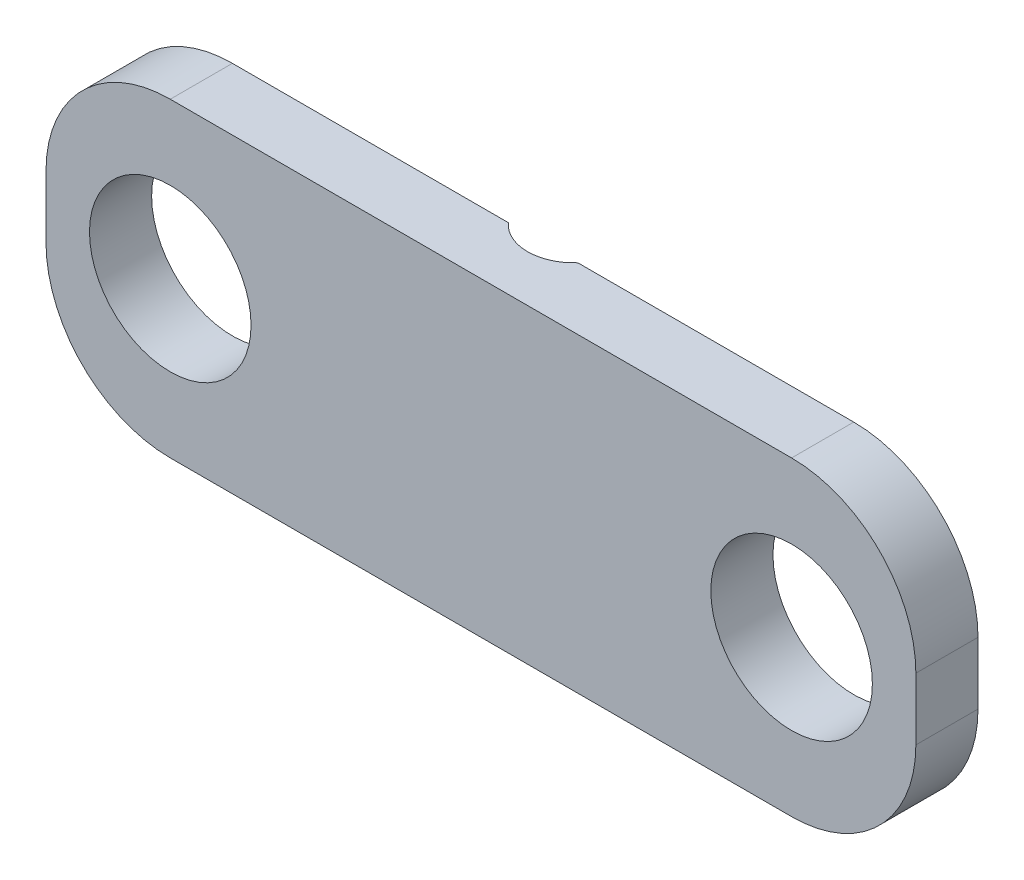
ISO-10303-21;
HEADER;
FILE_DESCRIPTION(('STEP AP214'),'2;1');
FILE_NAME('part.step','',(''),(''),'','','');
FILE_SCHEMA(('AUTOMOTIVE_DESIGN { 1 0 10303 214 1 1 1 1 }'));
ENDSEC;
DATA;
#1=APPLICATION_CONTEXT('core data for automotive mechanical design processes');
#2=APPLICATION_PROTOCOL_DEFINITION('international standard','automotive_design',2000,#1);
#3=PRODUCT_CONTEXT('',#1,'mechanical');
#4=PRODUCT('Part','Part','',(#3));
#5=PRODUCT_RELATED_PRODUCT_CATEGORY('part','',(#4));
#6=PRODUCT_DEFINITION_FORMATION('','',#4);
#7=PRODUCT_DEFINITION_CONTEXT('part definition',#1,'design');
#8=PRODUCT_DEFINITION('design','',#6,#7);
#9=PRODUCT_DEFINITION_SHAPE('','',#8);
#10=(LENGTH_UNIT() NAMED_UNIT(*) SI_UNIT(.MILLI.,.METRE.));
#11=(NAMED_UNIT(*) PLANE_ANGLE_UNIT() SI_UNIT($,.RADIAN.));
#12=(NAMED_UNIT(*) SI_UNIT($,.STERADIAN.) SOLID_ANGLE_UNIT());
#13=UNCERTAINTY_MEASURE_WITH_UNIT(LENGTH_MEASURE(1.E-05),#10,'distance_accuracy_value','');
#14=(GEOMETRIC_REPRESENTATION_CONTEXT(3) GLOBAL_UNCERTAINTY_ASSIGNED_CONTEXT((#13)) GLOBAL_UNIT_ASSIGNED_CONTEXT((#10,
#11,#12)) REPRESENTATION_CONTEXT('',''));
#15=CARTESIAN_POINT('',(0.,0.,0.));
#16=DIRECTION('',(0.,0.,1.));
#17=DIRECTION('',(1.,0.,0.));
#18=AXIS2_PLACEMENT_3D('',#15,#16,#17);
#19=CARTESIAN_POINT('',(5.,-0.5,0.));
#20=DIRECTION('',(0.,0.,1.));
#21=DIRECTION('',(1.,0.,0.));
#22=AXIS2_PLACEMENT_3D('',#19,#20,#21);
#23=PLANE('',#22);
#24=CARTESIAN_POINT('',(-5.,0.,0.));
#25=DIRECTION('',(0.,0.,-1.));
#26=DIRECTION('',(-1.,0.,0.));
#27=AXIS2_PLACEMENT_3D('',#24,#25,#26);
#28=CIRCLE('',#27,1.3);
#29=CARTESIAN_POINT('',(-6.3,0.,0.));
#30=VERTEX_POINT('',#29);
#31=EDGE_CURVE('E368',#30,#30,#28,.T.);
#32=ORIENTED_EDGE('',*,*,#31,.F.);
#33=EDGE_LOOP('',(#32));
#34=FACE_BOUND('',#33,.T.);
#35=DIRECTION('',(-1.,0.,0.));
#36=VECTOR('',#35,1.);
#37=CARTESIAN_POINT('',(-4.99999999999999,2.5,0.));
#38=LINE('',#37,#36);
#39=CARTESIAN_POINT('',(-0.559016994374948,2.5,0.));
#40=VERTEX_POINT('',#39);
#41=CARTESIAN_POINT('',(-4.99999999999999,2.5,0.));
#42=VERTEX_POINT('',#41);
#43=EDGE_CURVE('E162',#40,#42,#38,.T.);
#44=ORIENTED_EDGE('',*,*,#43,.F.);
#45=DIRECTION('',(0.,-1.,0.));
#46=VECTOR('',#45,1.);
#47=CARTESIAN_POINT('',(-0.559016994374948,2.501,0.));
#48=LINE('',#47,#46);
#49=CARTESIAN_POINT('',(-0.559016994374948,-2.5,0.));
#50=VERTEX_POINT('',#49);
#51=EDGE_CURVE('E216',#50,#40,#48,.F.);
#52=ORIENTED_EDGE('',*,*,#51,.F.);
#53=DIRECTION('',(1.,0.,0.));
#54=VECTOR('',#53,1.);
#55=CARTESIAN_POINT('',(-4.99999999999999,-2.5,0.));
#56=LINE('',#55,#54);
#57=CARTESIAN_POINT('',(-4.99999999999999,-2.5,0.));
#58=VERTEX_POINT('',#57);
#59=EDGE_CURVE('E175',#58,#50,#56,.T.);
#60=ORIENTED_EDGE('',*,*,#59,.F.);
#61=CARTESIAN_POINT('',(-5.,-0.5,0.));
#62=DIRECTION('',(0.,0.,1.));
#63=DIRECTION('',(1.,0.,0.));
#64=AXIS2_PLACEMENT_3D('',#61,#62,#63);
#65=CIRCLE('',#64,2.);
#66=CARTESIAN_POINT('',(-7.,-0.499999999999986,0.));
#67=VERTEX_POINT('',#66);
#68=EDGE_CURVE('E172',#67,#58,#65,.T.);
#69=ORIENTED_EDGE('',*,*,#68,.F.);
#70=DIRECTION('',(0.,-1.,0.));
#71=VECTOR('',#70,1.);
#72=CARTESIAN_POINT('',(-7.,0.499999999999986,0.));
#73=LINE('',#72,#71);
#74=CARTESIAN_POINT('',(-7.,0.499999999999986,0.));
#75=VERTEX_POINT('',#74);
#76=EDGE_CURVE('E135',#75,#67,#73,.T.);
#77=ORIENTED_EDGE('',*,*,#76,.F.);
#78=CARTESIAN_POINT('',(-5.,0.5,0.));
#79=DIRECTION('',(0.,0.,1.));
#80=DIRECTION('',(1.,0.,0.));
#81=AXIS2_PLACEMENT_3D('',#78,#79,#80);
#82=CIRCLE('',#81,2.);
#83=EDGE_CURVE('E167',#42,#75,#82,.T.);
#84=ORIENTED_EDGE('',*,*,#83,.F.);
#85=EDGE_LOOP('',(#44,#52,#60,#69,#77,#84));
#86=FACE_BOUND('',#85,.T.);
#87=ADVANCED_FACE('F38',(#34,#86),#23,.F.);
#88=CARTESIAN_POINT('',(0.559016994374948,-2.5,0.));
#89=VERTEX_POINT('',#88);
#90=CARTESIAN_POINT('',(4.99999999999999,-2.5,0.));
#91=VERTEX_POINT('',#90);
#92=EDGE_CURVE('E95',#89,#91,#56,.T.);
#93=ORIENTED_EDGE('',*,*,#92,.F.);
#94=DIRECTION('',(0.,-1.,0.));
#95=VECTOR('',#94,1.);
#96=CARTESIAN_POINT('',(0.559016994374948,2.501,0.));
#97=LINE('',#96,#95);
#98=CARTESIAN_POINT('',(0.559016994374948,2.5,0.));
#99=VERTEX_POINT('',#98);
#100=EDGE_CURVE('E54',#99,#89,#97,.T.);
#101=ORIENTED_EDGE('',*,*,#100,.F.);
#102=CARTESIAN_POINT('',(4.99999999999999,2.5,0.));
#103=VERTEX_POINT('',#102);
#104=EDGE_CURVE('E163',#103,#99,#38,.T.);
#105=ORIENTED_EDGE('',*,*,#104,.F.);
#106=CARTESIAN_POINT('',(5.,0.5,0.));
#107=DIRECTION('',(0.,0.,1.));
#108=DIRECTION('',(-1.,0.,0.));
#109=AXIS2_PLACEMENT_3D('',#106,#107,#108);
#110=CIRCLE('',#109,2.);
#111=CARTESIAN_POINT('',(7.,0.499999999999986,0.));
#112=VERTEX_POINT('',#111);
#113=EDGE_CURVE('E159',#112,#103,#110,.T.);
#114=ORIENTED_EDGE('',*,*,#113,.F.);
#115=DIRECTION('',(0.,1.,0.));
#116=VECTOR('',#115,1.);
#117=CARTESIAN_POINT('',(7.,0.499999999999986,0.));
#118=LINE('',#117,#116);
#119=CARTESIAN_POINT('',(7.,-0.499999999999986,0.));
#120=VERTEX_POINT('',#119);
#121=EDGE_CURVE('E155',#120,#112,#118,.T.);
#122=ORIENTED_EDGE('',*,*,#121,.F.);
#123=CARTESIAN_POINT('',(5.,-0.5,0.));
#124=DIRECTION('',(0.,0.,1.));
#125=DIRECTION('',(1.,0.,0.));
#126=AXIS2_PLACEMENT_3D('',#123,#124,#125);
#127=CIRCLE('',#126,2.);
#128=EDGE_CURVE('E151',#91,#120,#127,.T.);
#129=ORIENTED_EDGE('',*,*,#128,.F.);
#130=EDGE_LOOP('',(#93,#101,#105,#114,#122,#129));
#131=FACE_BOUND('',#130,.T.);
#132=CARTESIAN_POINT('',(5.,0.,0.));
#133=DIRECTION('',(0.,0.,-1.));
#134=DIRECTION('',(-1.,0.,0.));
#135=AXIS2_PLACEMENT_3D('',#132,#133,#134);
#136=CIRCLE('',#135,1.3);
#137=CARTESIAN_POINT('',(3.7,0.,0.));
#138=VERTEX_POINT('',#137);
#139=EDGE_CURVE('E374',#138,#138,#136,.T.);
#140=ORIENTED_EDGE('',*,*,#139,.F.);
#141=EDGE_LOOP('',(#140));
#142=FACE_BOUND('',#141,.T.);
#143=ADVANCED_FACE('F203',(#131,#142),#23,.F.);
#144=CARTESIAN_POINT('',(5.,-0.5,1.));
#145=DIRECTION('',(0.,0.,-1.));
#146=DIRECTION('',(-1.,0.,0.));
#147=AXIS2_PLACEMENT_3D('',#144,#145,#146);
#148=CYLINDRICAL_SURFACE('',#147,2.);
#149=ORIENTED_EDGE('',*,*,#128,.T.);
#150=DIRECTION('',(0.,0.,-1.));
#151=VECTOR('',#150,1.);
#152=CARTESIAN_POINT('',(7.,-0.499999999999986,1.));
#153=LINE('',#152,#151);
#154=CARTESIAN_POINT('',(7.,-0.499999999999986,1.));
#155=VERTEX_POINT('',#154);
#156=EDGE_CURVE('E11',#155,#120,#153,.T.);
#157=ORIENTED_EDGE('',*,*,#156,.F.);
#158=CARTESIAN_POINT('',(5.,-0.5,1.));
#159=DIRECTION('',(0.,0.,1.));
#160=DIRECTION('',(1.,0.,0.));
#161=AXIS2_PLACEMENT_3D('',#158,#159,#160);
#162=CIRCLE('',#161,2.);
#163=CARTESIAN_POINT('',(4.99999999999999,-2.5,1.));
#164=VERTEX_POINT('',#163);
#165=EDGE_CURVE('E179',#164,#155,#162,.T.);
#166=ORIENTED_EDGE('',*,*,#165,.F.);
#167=DIRECTION('',(0.,0.,-1.));
#168=VECTOR('',#167,1.);
#169=CARTESIAN_POINT('',(4.99999999999999,-2.5,1.));
#170=LINE('',#169,#168);
#171=EDGE_CURVE('E147',#164,#91,#170,.T.);
#172=ORIENTED_EDGE('',*,*,#171,.T.);
#173=EDGE_LOOP('',(#149,#157,#166,#172));
#174=FACE_BOUND('',#173,.T.);
#175=ADVANCED_FACE('F40',(#174),#148,.T.);
#176=CARTESIAN_POINT('',(7.,0.499999999999986,1.));
#177=DIRECTION('',(-1.,0.,0.));
#178=DIRECTION('',(0.,0.,1.));
#179=AXIS2_PLACEMENT_3D('',#176,#177,#178);
#180=PLANE('',#179);
#181=ORIENTED_EDGE('',*,*,#121,.T.);
#182=DIRECTION('',(0.,0.,-1.));
#183=VECTOR('',#182,1.);
#184=CARTESIAN_POINT('',(7.,0.499999999999986,1.));
#185=LINE('',#184,#183);
#186=CARTESIAN_POINT('',(7.,0.499999999999986,1.));
#187=VERTEX_POINT('',#186);
#188=EDGE_CURVE('E47',#187,#112,#185,.T.);
#189=ORIENTED_EDGE('',*,*,#188,.F.);
#190=DIRECTION('',(0.,1.,0.));
#191=VECTOR('',#190,1.);
#192=CARTESIAN_POINT('',(7.,0.499999999999986,1.));
#193=LINE('',#192,#191);
#194=EDGE_CURVE('E103',#155,#187,#193,.T.);
#195=ORIENTED_EDGE('',*,*,#194,.F.);
#196=ORIENTED_EDGE('',*,*,#156,.T.);
#197=EDGE_LOOP('',(#181,#189,#195,#196));
#198=FACE_BOUND('',#197,.T.);
#199=ADVANCED_FACE('F344',(#198),#180,.F.);
#200=CARTESIAN_POINT('',(5.,0.5,1.));
#201=DIRECTION('',(0.,0.,-1.));
#202=DIRECTION('',(-1.,0.,0.));
#203=AXIS2_PLACEMENT_3D('',#200,#201,#202);
#204=CYLINDRICAL_SURFACE('',#203,2.);
#205=ORIENTED_EDGE('',*,*,#113,.T.);
#206=DIRECTION('',(0.,0.,-1.));
#207=VECTOR('',#206,1.);
#208=CARTESIAN_POINT('',(4.99999999999999,2.5,1.));
#209=LINE('',#208,#207);
#210=CARTESIAN_POINT('',(4.99999999999999,2.5,1.));
#211=VERTEX_POINT('',#210);
#212=EDGE_CURVE('E190',#211,#103,#209,.T.);
#213=ORIENTED_EDGE('',*,*,#212,.F.);
#214=CARTESIAN_POINT('',(5.,0.5,1.));
#215=DIRECTION('',(0.,0.,1.));
#216=DIRECTION('',(-1.,0.,0.));
#217=AXIS2_PLACEMENT_3D('',#214,#215,#216);
#218=CIRCLE('',#217,2.);
#219=EDGE_CURVE('E200',#187,#211,#218,.T.);
#220=ORIENTED_EDGE('',*,*,#219,.F.);
#221=ORIENTED_EDGE('',*,*,#188,.T.);
#222=EDGE_LOOP('',(#205,#213,#220,#221));
#223=FACE_BOUND('',#222,.T.);
#224=ADVANCED_FACE('F198',(#223),#204,.T.);
#225=CARTESIAN_POINT('',(-4.99999999999999,2.5,1.));
#226=DIRECTION('',(0.,-1.,0.));
#227=DIRECTION('',(0.,0.,-1.));
#228=AXIS2_PLACEMENT_3D('',#225,#226,#227);
#229=PLANE('',#228);
#230=ORIENTED_EDGE('',*,*,#104,.T.);
#231=CARTESIAN_POINT('',(0.,2.5,-0.5));
#232=DIRECTION('',(0.,-1.,0.));
#233=DIRECTION('',(0.,0.,-1.));
#234=AXIS2_PLACEMENT_3D('',#231,#232,#233);
#235=CIRCLE('',#234,0.75);
#236=EDGE_CURVE('E210',#40,#99,#235,.F.);
#237=ORIENTED_EDGE('',*,*,#236,.F.);
#238=ORIENTED_EDGE('',*,*,#43,.T.);
#239=DIRECTION('',(0.,0.,-1.));
#240=VECTOR('',#239,1.);
#241=CARTESIAN_POINT('',(-4.99999999999999,2.5,1.));
#242=LINE('',#241,#240);
#243=CARTESIAN_POINT('',(-4.99999999999999,2.5,1.));
#244=VERTEX_POINT('',#243);
#245=EDGE_CURVE('E186',#244,#42,#242,.T.);
#246=ORIENTED_EDGE('',*,*,#245,.F.);
#247=DIRECTION('',(-1.,0.,0.));
#248=VECTOR('',#247,1.);
#249=CARTESIAN_POINT('',(-4.99999999999999,2.5,1.));
#250=LINE('',#249,#248);
#251=EDGE_CURVE('E240',#211,#244,#250,.T.);
#252=ORIENTED_EDGE('',*,*,#251,.F.);
#253=ORIENTED_EDGE('',*,*,#212,.T.);
#254=EDGE_LOOP('',(#230,#237,#238,#246,#252,#253));
#255=FACE_BOUND('',#254,.T.);
#256=ADVANCED_FACE('F208',(#255),#229,.F.);
#257=CARTESIAN_POINT('',(-5.,0.5,1.));
#258=DIRECTION('',(0.,0.,-1.));
#259=DIRECTION('',(-1.,0.,0.));
#260=AXIS2_PLACEMENT_3D('',#257,#258,#259);
#261=CYLINDRICAL_SURFACE('',#260,2.);
#262=ORIENTED_EDGE('',*,*,#83,.T.);
#263=DIRECTION('',(0.,0.,-1.));
#264=VECTOR('',#263,1.);
#265=CARTESIAN_POINT('',(-7.,0.499999999999986,1.));
#266=LINE('',#265,#264);
#267=CARTESIAN_POINT('',(-7.,0.499999999999986,1.));
#268=VERTEX_POINT('',#267);
#269=EDGE_CURVE('E139',#268,#75,#266,.T.);
#270=ORIENTED_EDGE('',*,*,#269,.F.);
#271=CARTESIAN_POINT('',(-5.,0.5,1.));
#272=DIRECTION('',(0.,0.,1.));
#273=DIRECTION('',(1.,0.,0.));
#274=AXIS2_PLACEMENT_3D('',#271,#272,#273);
#275=CIRCLE('',#274,2.);
#276=EDGE_CURVE('E125',#244,#268,#275,.T.);
#277=ORIENTED_EDGE('',*,*,#276,.F.);
#278=ORIENTED_EDGE('',*,*,#245,.T.);
#279=EDGE_LOOP('',(#262,#270,#277,#278));
#280=FACE_BOUND('',#279,.T.);
#281=ADVANCED_FACE('F245',(#280),#261,.T.);
#282=CARTESIAN_POINT('',(-7.,0.499999999999986,1.));
#283=DIRECTION('',(1.,0.,0.));
#284=DIRECTION('',(0.,0.,-1.));
#285=AXIS2_PLACEMENT_3D('',#282,#283,#284);
#286=PLANE('',#285);
#287=ORIENTED_EDGE('',*,*,#76,.T.);
#288=DIRECTION('',(0.,0.,-1.));
#289=VECTOR('',#288,1.);
#290=CARTESIAN_POINT('',(-7.,-0.499999999999986,1.));
#291=LINE('',#290,#289);
#292=CARTESIAN_POINT('',(-7.,-0.499999999999986,1.));
#293=VERTEX_POINT('',#292);
#294=EDGE_CURVE('E132',#293,#67,#291,.T.);
#295=ORIENTED_EDGE('',*,*,#294,.F.);
#296=DIRECTION('',(0.,-1.,0.));
#297=VECTOR('',#296,1.);
#298=CARTESIAN_POINT('',(-7.,0.499999999999986,1.));
#299=LINE('',#298,#297);
#300=EDGE_CURVE('E118',#268,#293,#299,.T.);
#301=ORIENTED_EDGE('',*,*,#300,.F.);
#302=ORIENTED_EDGE('',*,*,#269,.T.);
#303=EDGE_LOOP('',(#287,#295,#301,#302));
#304=FACE_BOUND('',#303,.T.);
#305=ADVANCED_FACE('F133',(#304),#286,.F.);
#306=CARTESIAN_POINT('',(-5.,-0.5,1.));
#307=DIRECTION('',(0.,0.,-1.));
#308=DIRECTION('',(-1.,0.,0.));
#309=AXIS2_PLACEMENT_3D('',#306,#307,#308);
#310=CYLINDRICAL_SURFACE('',#309,2.);
#311=ORIENTED_EDGE('',*,*,#68,.T.);
#312=DIRECTION('',(0.,0.,-1.));
#313=VECTOR('',#312,1.);
#314=CARTESIAN_POINT('',(-4.99999999999999,-2.5,1.));
#315=LINE('',#314,#313);
#316=CARTESIAN_POINT('',(-4.99999999999999,-2.5,1.));
#317=VERTEX_POINT('',#316);
#318=EDGE_CURVE('E140',#317,#58,#315,.T.);
#319=ORIENTED_EDGE('',*,*,#318,.F.);
#320=CARTESIAN_POINT('',(-5.,-0.5,1.));
#321=DIRECTION('',(0.,0.,1.));
#322=DIRECTION('',(1.,0.,0.));
#323=AXIS2_PLACEMENT_3D('',#320,#321,#322);
#324=CIRCLE('',#323,2.);
#325=EDGE_CURVE('E122',#293,#317,#324,.T.);
#326=ORIENTED_EDGE('',*,*,#325,.F.);
#327=ORIENTED_EDGE('',*,*,#294,.T.);
#328=EDGE_LOOP('',(#311,#319,#326,#327));
#329=FACE_BOUND('',#328,.T.);
#330=ADVANCED_FACE('F142',(#329),#310,.T.);
#331=CARTESIAN_POINT('',(-4.99999999999999,-2.5,1.));
#332=DIRECTION('',(0.,1.,0.));
#333=DIRECTION('',(0.,0.,1.));
#334=AXIS2_PLACEMENT_3D('',#331,#332,#333);
#335=PLANE('',#334);
#336=ORIENTED_EDGE('',*,*,#59,.T.);
#337=CARTESIAN_POINT('',(0.,-2.5,-0.5));
#338=DIRECTION('',(0.,-1.,0.));
#339=DIRECTION('',(0.,0.,-1.));
#340=AXIS2_PLACEMENT_3D('',#337,#338,#339);
#341=CIRCLE('',#340,0.75);
#342=EDGE_CURVE('E218',#89,#50,#341,.T.);
#343=ORIENTED_EDGE('',*,*,#342,.F.);
#344=ORIENTED_EDGE('',*,*,#92,.T.);
#345=ORIENTED_EDGE('',*,*,#171,.F.);
#346=DIRECTION('',(1.,0.,0.));
#347=VECTOR('',#346,1.);
#348=CARTESIAN_POINT('',(-4.99999999999999,-2.5,1.));
#349=LINE('',#348,#347);
#350=EDGE_CURVE('E63',#317,#164,#349,.T.);
#351=ORIENTED_EDGE('',*,*,#350,.F.);
#352=ORIENTED_EDGE('',*,*,#318,.T.);
#353=EDGE_LOOP('',(#336,#343,#344,#345,#351,#352));
#354=FACE_BOUND('',#353,.T.);
#355=ADVANCED_FACE('F227',(#354),#335,.F.);
#356=CARTESIAN_POINT('',(5.,-0.5,1.));
#357=DIRECTION('',(0.,0.,1.));
#358=DIRECTION('',(1.,0.,0.));
#359=AXIS2_PLACEMENT_3D('',#356,#357,#358);
#360=PLANE('',#359);
#361=CARTESIAN_POINT('',(5.,0.,1.));
#362=DIRECTION('',(0.,0.,1.));
#363=DIRECTION('',(1.,0.,0.));
#364=AXIS2_PLACEMENT_3D('',#361,#362,#363);
#365=CIRCLE('',#364,1.3);
#366=CARTESIAN_POINT('',(6.3,0.,1.));
#367=VERTEX_POINT('',#366);
#368=EDGE_CURVE('E371',#367,#367,#365,.T.);
#369=ORIENTED_EDGE('',*,*,#368,.F.);
#370=EDGE_LOOP('',(#369));
#371=FACE_BOUND('',#370,.T.);
#372=CARTESIAN_POINT('',(-5.,0.,1.));
#373=DIRECTION('',(0.,0.,1.));
#374=DIRECTION('',(1.,0.,0.));
#375=AXIS2_PLACEMENT_3D('',#372,#373,#374);
#376=CIRCLE('',#375,1.3);
#377=CARTESIAN_POINT('',(-3.7,0.,1.));
#378=VERTEX_POINT('',#377);
#379=EDGE_CURVE('E156',#378,#378,#376,.T.);
#380=ORIENTED_EDGE('',*,*,#379,.F.);
#381=EDGE_LOOP('',(#380));
#382=FACE_BOUND('',#381,.T.);
#383=ORIENTED_EDGE('',*,*,#165,.T.);
#384=ORIENTED_EDGE('',*,*,#194,.T.);
#385=ORIENTED_EDGE('',*,*,#219,.T.);
#386=ORIENTED_EDGE('',*,*,#251,.T.);
#387=ORIENTED_EDGE('',*,*,#276,.T.);
#388=ORIENTED_EDGE('',*,*,#300,.T.);
#389=ORIENTED_EDGE('',*,*,#325,.T.);
#390=ORIENTED_EDGE('',*,*,#350,.T.);
#391=EDGE_LOOP('',(#383,#384,#385,#386,#387,#388,#389,#390));
#392=FACE_BOUND('',#391,.T.);
#393=ADVANCED_FACE('F120',(#371,#382,#392),#360,.T.);
#394=CARTESIAN_POINT('',(-5.,0.,0.));
#395=DIRECTION('',(0.,0.,-1.));
#396=DIRECTION('',(-1.,0.,0.));
#397=AXIS2_PLACEMENT_3D('',#394,#395,#396);
#398=CYLINDRICAL_SURFACE('',#397,1.3);
#399=ORIENTED_EDGE('',*,*,#31,.T.);
#400=EDGE_LOOP('',(#399));
#401=FACE_BOUND('',#400,.T.);
#402=ORIENTED_EDGE('',*,*,#379,.T.);
#403=EDGE_LOOP('',(#402));
#404=FACE_BOUND('',#403,.T.);
#405=ADVANCED_FACE('F283',(#401,#404),#398,.F.);
#406=CARTESIAN_POINT('',(5.,0.,0.));
#407=DIRECTION('',(0.,0.,-1.));
#408=DIRECTION('',(-1.,0.,0.));
#409=AXIS2_PLACEMENT_3D('',#406,#407,#408);
#410=CYLINDRICAL_SURFACE('',#409,1.3);
#411=ORIENTED_EDGE('',*,*,#139,.T.);
#412=EDGE_LOOP('',(#411));
#413=FACE_BOUND('',#412,.T.);
#414=ORIENTED_EDGE('',*,*,#368,.T.);
#415=EDGE_LOOP('',(#414));
#416=FACE_BOUND('',#415,.T.);
#417=ADVANCED_FACE('F290',(#413,#416),#410,.F.);
#418=CARTESIAN_POINT('',(0.,2.501,-0.5));
#419=DIRECTION('',(0.,-1.,0.));
#420=DIRECTION('',(0.,0.,-1.));
#421=AXIS2_PLACEMENT_3D('',#418,#419,#420);
#422=CYLINDRICAL_SURFACE('',#421,0.75);
#423=ORIENTED_EDGE('',*,*,#51,.T.);
#424=ORIENTED_EDGE('',*,*,#236,.T.);
#425=ORIENTED_EDGE('',*,*,#100,.T.);
#426=ORIENTED_EDGE('',*,*,#342,.T.);
#427=EDGE_LOOP('',(#423,#424,#425,#426));
#428=FACE_BOUND('',#427,.T.);
#429=ADVANCED_FACE('F219',(#428),#422,.F.);
#430=CLOSED_SHELL('',(#87,#143,#175,#199,#224,#256,#281,#305,#330,#355,#393,#405,#417,#429));
#431=MANIFOLD_SOLID_BREP('B2',#430);
#432=ADVANCED_BREP_SHAPE_REPRESENTATION('',(#18,#431),#14);
#433=SHAPE_DEFINITION_REPRESENTATION(#9,#432);
ENDSEC;
END-ISO-10303-21;
